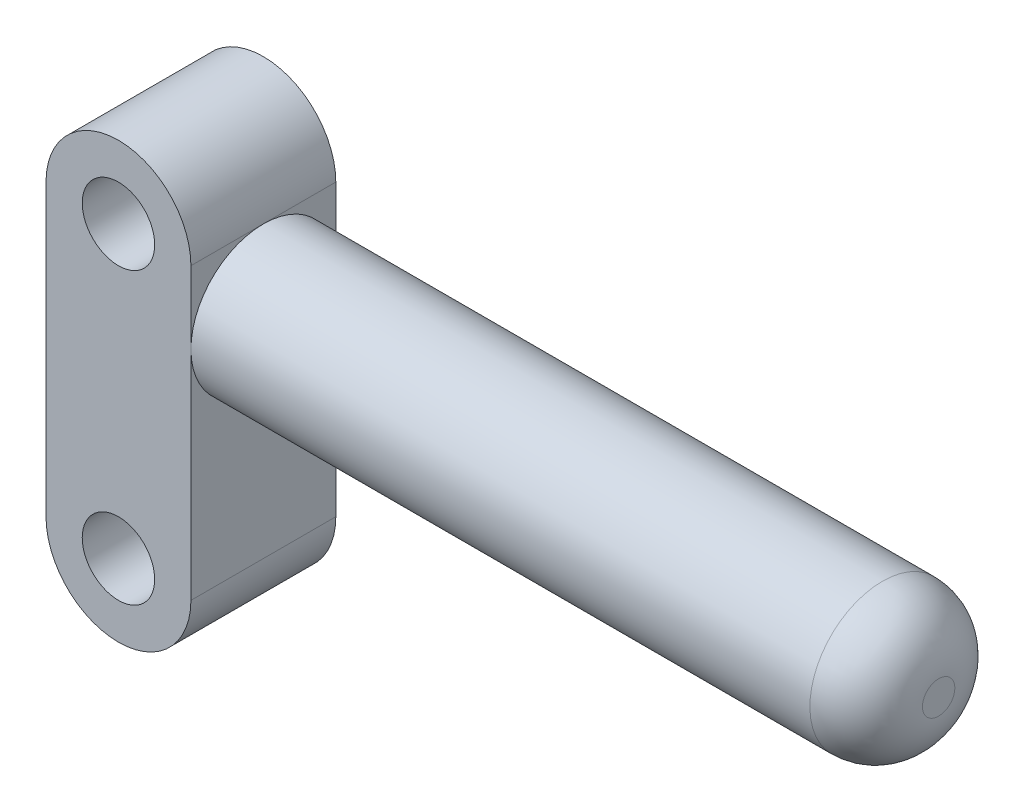
ISO-10303-21;
HEADER;
FILE_DESCRIPTION(('STEP AP214'),'2;1');
FILE_NAME('part.step','',(''),(''),'','','');
FILE_SCHEMA(('AUTOMOTIVE_DESIGN { 1 0 10303 214 1 1 1 1 }'));
ENDSEC;
DATA;
#1=APPLICATION_CONTEXT('core data for automotive mechanical design processes');
#2=APPLICATION_PROTOCOL_DEFINITION('international standard','automotive_design',2000,#1);
#3=PRODUCT_CONTEXT('',#1,'mechanical');
#4=PRODUCT('Part','Part','',(#3));
#5=PRODUCT_RELATED_PRODUCT_CATEGORY('part','',(#4));
#6=PRODUCT_DEFINITION_FORMATION('','',#4);
#7=PRODUCT_DEFINITION_CONTEXT('part definition',#1,'design');
#8=PRODUCT_DEFINITION('design','',#6,#7);
#9=PRODUCT_DEFINITION_SHAPE('','',#8);
#10=(LENGTH_UNIT() NAMED_UNIT(*) SI_UNIT(.MILLI.,.METRE.));
#11=(NAMED_UNIT(*) PLANE_ANGLE_UNIT() SI_UNIT($,.RADIAN.));
#12=(NAMED_UNIT(*) SI_UNIT($,.STERADIAN.) SOLID_ANGLE_UNIT());
#13=UNCERTAINTY_MEASURE_WITH_UNIT(LENGTH_MEASURE(1.E-05),#10,'distance_accuracy_value','');
#14=(GEOMETRIC_REPRESENTATION_CONTEXT(3) GLOBAL_UNCERTAINTY_ASSIGNED_CONTEXT((#13)) GLOBAL_UNIT_ASSIGNED_CONTEXT((#10,
#11,#12)) REPRESENTATION_CONTEXT('',''));
#15=CARTESIAN_POINT('',(0.,0.,0.));
#16=DIRECTION('',(0.,0.,1.));
#17=DIRECTION('',(1.,0.,0.));
#18=AXIS2_PLACEMENT_3D('',#15,#16,#17);
#19=CARTESIAN_POINT('',(5.,10.,5.));
#20=DIRECTION('',(-1.,0.,0.));
#21=DIRECTION('',(0.,-1.,0.));
#22=AXIS2_PLACEMENT_3D('',#19,#20,#21);
#23=PLANE('',#22);
#24=CARTESIAN_POINT('',(5.,5.,0.));
#25=DIRECTION('',(-1.,0.,0.));
#26=DIRECTION('',(0.,-1.,0.));
#27=AXIS2_PLACEMENT_3D('',#24,#25,#26);
#28=CIRCLE('',#27,5.);
#29=CARTESIAN_POINT('',(5.,5.,-5.));
#30=VERTEX_POINT('',#29);
#31=CARTESIAN_POINT('',(5.,10.,0.));
#32=VERTEX_POINT('',#31);
#33=EDGE_CURVE('E107',#30,#32,#28,.F.);
#34=ORIENTED_EDGE('',*,*,#33,.F.);
#35=DIRECTION('',(0.,1.,0.));
#36=VECTOR('',#35,1.);
#37=CARTESIAN_POINT('',(5.,10.,-5.));
#38=LINE('',#37,#36);
#39=CARTESIAN_POINT('',(5.,10.,-5.));
#40=VERTEX_POINT('',#39);
#41=EDGE_CURVE('E95',#30,#40,#38,.T.);
#42=ORIENTED_EDGE('',*,*,#41,.T.);
#43=DIRECTION('',(0.,0.,-1.));
#44=VECTOR('',#43,1.);
#45=CARTESIAN_POINT('',(5.,10.,5.));
#46=LINE('',#45,#44);
#47=EDGE_CURVE('E108',#32,#40,#46,.T.);
#48=ORIENTED_EDGE('',*,*,#47,.F.);
#49=EDGE_LOOP('',(#34,#42,#48));
#50=FACE_BOUND('',#49,.T.);
#51=ADVANCED_FACE('F36',(#50),#23,.F.);
#52=CARTESIAN_POINT('',(5.,5.,0.));
#53=DIRECTION('',(1.,0.,0.));
#54=DIRECTION('',(0.,1.,0.));
#55=AXIS2_PLACEMENT_3D('',#52,#53,#54);
#56=CIRCLE('',#55,5.);
#57=CARTESIAN_POINT('',(5.,5.,5.));
#58=VERTEX_POINT('',#57);
#59=EDGE_CURVE('E58',#32,#58,#56,.T.);
#60=ORIENTED_EDGE('',*,*,#59,.F.);
#61=CARTESIAN_POINT('',(5.,10.,5.));
#62=VERTEX_POINT('',#61);
#63=EDGE_CURVE('E176',#62,#32,#46,.T.);
#64=ORIENTED_EDGE('',*,*,#63,.F.);
#65=DIRECTION('',(0.,1.,0.));
#66=VECTOR('',#65,1.);
#67=CARTESIAN_POINT('',(5.,10.,5.));
#68=LINE('',#67,#66);
#69=EDGE_CURVE('E188',#58,#62,#68,.T.);
#70=ORIENTED_EDGE('',*,*,#69,.F.);
#71=EDGE_LOOP('',(#60,#64,#70));
#72=FACE_BOUND('',#71,.T.);
#73=ADVANCED_FACE('F131',(#72),#23,.F.);
#74=CARTESIAN_POINT('',(0.,10.,5.));
#75=DIRECTION('',(0.,0.,1.));
#76=DIRECTION('',(1.,0.,0.));
#77=AXIS2_PLACEMENT_3D('',#74,#75,#76);
#78=PLANE('',#77);
#79=CARTESIAN_POINT('',(0.,10.,5.));
#80=DIRECTION('',(0.,0.,1.));
#81=DIRECTION('',(1.,0.,0.));
#82=AXIS2_PLACEMENT_3D('',#79,#80,#81);
#83=CIRCLE('',#82,2.5);
#84=CARTESIAN_POINT('',(2.5,10.,5.));
#85=VERTEX_POINT('',#84);
#86=EDGE_CURVE('E165',#85,#85,#83,.T.);
#87=ORIENTED_EDGE('',*,*,#86,.F.);
#88=EDGE_LOOP('',(#87));
#89=FACE_BOUND('',#88,.T.);
#90=CARTESIAN_POINT('',(0.,10.,5.));
#91=DIRECTION('',(0.,0.,1.));
#92=DIRECTION('',(1.,0.,0.));
#93=AXIS2_PLACEMENT_3D('',#90,#91,#92);
#94=CIRCLE('',#93,5.);
#95=CARTESIAN_POINT('',(-5.,10.,5.));
#96=VERTEX_POINT('',#95);
#97=EDGE_CURVE('E94',#62,#96,#94,.T.);
#98=ORIENTED_EDGE('',*,*,#97,.T.);
#99=DIRECTION('',(0.,-1.,0.));
#100=VECTOR('',#99,1.);
#101=CARTESIAN_POINT('',(-5.,10.,5.));
#102=LINE('',#101,#100);
#103=CARTESIAN_POINT('',(-4.99999999999999,-10.,5.));
#104=VERTEX_POINT('',#103);
#105=EDGE_CURVE('E182',#96,#104,#102,.T.);
#106=ORIENTED_EDGE('',*,*,#105,.T.);
#107=CARTESIAN_POINT('',(0.,-10.,5.));
#108=DIRECTION('',(0.,0.,1.));
#109=DIRECTION('',(1.,0.,0.));
#110=AXIS2_PLACEMENT_3D('',#107,#108,#109);
#111=CIRCLE('',#110,5.);
#112=CARTESIAN_POINT('',(5.,-10.,5.));
#113=VERTEX_POINT('',#112);
#114=EDGE_CURVE('E181',#104,#113,#111,.T.);
#115=ORIENTED_EDGE('',*,*,#114,.T.);
#116=EDGE_CURVE('E172',#113,#58,#68,.T.);
#117=ORIENTED_EDGE('',*,*,#116,.T.);
#118=ORIENTED_EDGE('',*,*,#69,.T.);
#119=EDGE_LOOP('',(#98,#106,#115,#117,#118));
#120=FACE_BOUND('',#119,.T.);
#121=CARTESIAN_POINT('',(0.,-10.,5.));
#122=DIRECTION('',(0.,0.,1.));
#123=DIRECTION('',(-1.,0.,0.));
#124=AXIS2_PLACEMENT_3D('',#121,#122,#123);
#125=CIRCLE('',#124,2.5);
#126=CARTESIAN_POINT('',(-2.5,-10.,5.));
#127=VERTEX_POINT('',#126);
#128=EDGE_CURVE('E192',#127,#127,#125,.T.);
#129=ORIENTED_EDGE('',*,*,#128,.F.);
#130=EDGE_LOOP('',(#129));
#131=FACE_BOUND('',#130,.T.);
#132=ADVANCED_FACE('F136',(#89,#120,#131),#78,.T.);
#133=CARTESIAN_POINT('',(0.,10.,-5.));
#134=DIRECTION('',(0.,0.,1.));
#135=DIRECTION('',(1.,0.,0.));
#136=AXIS2_PLACEMENT_3D('',#133,#134,#135);
#137=PLANE('',#136);
#138=CARTESIAN_POINT('',(0.,10.,-5.));
#139=DIRECTION('',(0.,0.,1.));
#140=DIRECTION('',(1.,0.,0.));
#141=AXIS2_PLACEMENT_3D('',#138,#139,#140);
#142=CIRCLE('',#141,5.);
#143=CARTESIAN_POINT('',(-5.,10.,-5.));
#144=VERTEX_POINT('',#143);
#145=EDGE_CURVE('E103',#40,#144,#142,.T.);
#146=ORIENTED_EDGE('',*,*,#145,.F.);
#147=ORIENTED_EDGE('',*,*,#41,.F.);
#148=CARTESIAN_POINT('',(5.,-10.,-5.));
#149=VERTEX_POINT('',#148);
#150=EDGE_CURVE('E87',#149,#30,#38,.T.);
#151=ORIENTED_EDGE('',*,*,#150,.F.);
#152=CARTESIAN_POINT('',(0.,-10.,-5.));
#153=DIRECTION('',(0.,0.,1.));
#154=DIRECTION('',(1.,0.,0.));
#155=AXIS2_PLACEMENT_3D('',#152,#153,#154);
#156=CIRCLE('',#155,5.);
#157=CARTESIAN_POINT('',(-4.99999999999999,-10.,-5.));
#158=VERTEX_POINT('',#157);
#159=EDGE_CURVE('E105',#158,#149,#156,.T.);
#160=ORIENTED_EDGE('',*,*,#159,.F.);
#161=DIRECTION('',(0.,-1.,0.));
#162=VECTOR('',#161,1.);
#163=CARTESIAN_POINT('',(-5.,10.,-5.));
#164=LINE('',#163,#162);
#165=EDGE_CURVE('E164',#144,#158,#164,.T.);
#166=ORIENTED_EDGE('',*,*,#165,.F.);
#167=EDGE_LOOP('',(#146,#147,#151,#160,#166));
#168=FACE_BOUND('',#167,.T.);
#169=CARTESIAN_POINT('',(0.,10.,-5.));
#170=DIRECTION('',(0.,0.,1.));
#171=DIRECTION('',(1.,0.,0.));
#172=AXIS2_PLACEMENT_3D('',#169,#170,#171);
#173=CIRCLE('',#172,2.5);
#174=CARTESIAN_POINT('',(2.5,10.,-5.));
#175=VERTEX_POINT('',#174);
#176=EDGE_CURVE('E169',#175,#175,#173,.T.);
#177=ORIENTED_EDGE('',*,*,#176,.T.);
#178=EDGE_LOOP('',(#177));
#179=FACE_BOUND('',#178,.T.);
#180=CARTESIAN_POINT('',(0.,-10.,-5.));
#181=DIRECTION('',(0.,0.,1.));
#182=DIRECTION('',(-1.,0.,0.));
#183=AXIS2_PLACEMENT_3D('',#180,#181,#182);
#184=CIRCLE('',#183,2.5);
#185=CARTESIAN_POINT('',(-2.5,-10.,-5.));
#186=VERTEX_POINT('',#185);
#187=EDGE_CURVE('E194',#186,#186,#184,.T.);
#188=ORIENTED_EDGE('',*,*,#187,.T.);
#189=EDGE_LOOP('',(#188));
#190=FACE_BOUND('',#189,.T.);
#191=ADVANCED_FACE('F100',(#168,#179,#190),#137,.F.);
#192=CARTESIAN_POINT('',(0.,10.,5.));
#193=DIRECTION('',(0.,0.,-1.));
#194=DIRECTION('',(-1.,0.,0.));
#195=AXIS2_PLACEMENT_3D('',#192,#193,#194);
#196=CYLINDRICAL_SURFACE('',#195,5.);
#197=ORIENTED_EDGE('',*,*,#145,.T.);
#198=DIRECTION('',(0.,0.,-1.));
#199=VECTOR('',#198,1.);
#200=CARTESIAN_POINT('',(-5.,10.,5.));
#201=LINE('',#200,#199);
#202=EDGE_CURVE('E113',#96,#144,#201,.T.);
#203=ORIENTED_EDGE('',*,*,#202,.F.);
#204=ORIENTED_EDGE('',*,*,#97,.F.);
#205=ORIENTED_EDGE('',*,*,#63,.T.);
#206=ORIENTED_EDGE('',*,*,#47,.T.);
#207=EDGE_LOOP('',(#197,#203,#204,#205,#206));
#208=FACE_BOUND('',#207,.T.);
#209=ADVANCED_FACE('F154',(#208),#196,.T.);
#210=CARTESIAN_POINT('',(-5.,10.,5.));
#211=DIRECTION('',(1.,0.,0.));
#212=DIRECTION('',(0.,1.,0.));
#213=AXIS2_PLACEMENT_3D('',#210,#211,#212);
#214=PLANE('',#213);
#215=ORIENTED_EDGE('',*,*,#165,.T.);
#216=DIRECTION('',(0.,0.,-1.));
#217=VECTOR('',#216,1.);
#218=CARTESIAN_POINT('',(-4.99999999999999,-10.,5.));
#219=LINE('',#218,#217);
#220=EDGE_CURVE('E115',#104,#158,#219,.T.);
#221=ORIENTED_EDGE('',*,*,#220,.F.);
#222=ORIENTED_EDGE('',*,*,#105,.F.);
#223=ORIENTED_EDGE('',*,*,#202,.T.);
#224=EDGE_LOOP('',(#215,#221,#222,#223));
#225=FACE_BOUND('',#224,.T.);
#226=ADVANCED_FACE('F149',(#225),#214,.F.);
#227=CARTESIAN_POINT('',(0.,-10.,5.));
#228=DIRECTION('',(0.,0.,-1.));
#229=DIRECTION('',(-1.,0.,0.));
#230=AXIS2_PLACEMENT_3D('',#227,#228,#229);
#231=CYLINDRICAL_SURFACE('',#230,5.);
#232=ORIENTED_EDGE('',*,*,#159,.T.);
#233=DIRECTION('',(0.,0.,-1.));
#234=VECTOR('',#233,1.);
#235=CARTESIAN_POINT('',(5.,-10.,5.));
#236=LINE('',#235,#234);
#237=EDGE_CURVE('E91',#113,#149,#236,.T.);
#238=ORIENTED_EDGE('',*,*,#237,.F.);
#239=ORIENTED_EDGE('',*,*,#114,.F.);
#240=ORIENTED_EDGE('',*,*,#220,.T.);
#241=EDGE_LOOP('',(#232,#238,#239,#240));
#242=FACE_BOUND('',#241,.T.);
#243=ADVANCED_FACE('F141',(#242),#231,.T.);
#244=EDGE_CURVE('E51',#58,#30,#28,.F.);
#245=ORIENTED_EDGE('',*,*,#244,.F.);
#246=ORIENTED_EDGE('',*,*,#116,.F.);
#247=ORIENTED_EDGE('',*,*,#237,.T.);
#248=ORIENTED_EDGE('',*,*,#150,.T.);
#249=EDGE_LOOP('',(#245,#246,#247,#248));
#250=FACE_BOUND('',#249,.T.);
#251=ADVANCED_FACE('F89',(#250),#23,.F.);
#252=CARTESIAN_POINT('',(0.,10.,5.));
#253=DIRECTION('',(0.,0.,-1.));
#254=DIRECTION('',(-1.,0.,0.));
#255=AXIS2_PLACEMENT_3D('',#252,#253,#254);
#256=CYLINDRICAL_SURFACE('',#255,2.5);
#257=ORIENTED_EDGE('',*,*,#86,.T.);
#258=EDGE_LOOP('',(#257));
#259=FACE_BOUND('',#258,.T.);
#260=ORIENTED_EDGE('',*,*,#176,.F.);
#261=EDGE_LOOP('',(#260));
#262=FACE_BOUND('',#261,.T.);
#263=ADVANCED_FACE('F140',(#259,#262),#256,.F.);
#264=CARTESIAN_POINT('',(0.,-10.,5.));
#265=DIRECTION('',(0.,0.,-1.));
#266=DIRECTION('',(-1.,0.,0.));
#267=AXIS2_PLACEMENT_3D('',#264,#265,#266);
#268=CYLINDRICAL_SURFACE('',#267,2.5);
#269=ORIENTED_EDGE('',*,*,#128,.T.);
#270=EDGE_LOOP('',(#269));
#271=FACE_BOUND('',#270,.T.);
#272=ORIENTED_EDGE('',*,*,#187,.F.);
#273=EDGE_LOOP('',(#272));
#274=FACE_BOUND('',#273,.T.);
#275=ADVANCED_FACE('F146',(#271,#274),#268,.F.);
#276=CARTESIAN_POINT('',(51.6,5.00000000000002,0.));
#277=DIRECTION('',(-1.,0.,0.));
#278=DIRECTION('',(0.,-1.,0.));
#279=AXIS2_PLACEMENT_3D('',#276,#277,#278);
#280=CYLINDRICAL_SURFACE('',#279,5.);
#281=CARTESIAN_POINT('',(47.7166666666667,5.00000000000002,0.));
#282=DIRECTION('',(1.,0.,0.));
#283=DIRECTION('',(0.,1.,0.));
#284=AXIS2_PLACEMENT_3D('',#281,#282,#283);
#285=CIRCLE('',#284,5.);
#286=CARTESIAN_POINT('',(47.7166666666667,10.,0.));
#287=VERTEX_POINT('',#286);
#288=EDGE_CURVE('E11',#287,#287,#285,.F.);
#289=ORIENTED_EDGE('',*,*,#288,.T.);
#290=EDGE_LOOP('',(#289));
#291=FACE_BOUND('',#290,.T.);
#292=ORIENTED_EDGE('',*,*,#59,.T.);
#293=ORIENTED_EDGE('',*,*,#244,.T.);
#294=ORIENTED_EDGE('',*,*,#33,.T.);
#295=EDGE_LOOP('',(#292,#293,#294));
#296=FACE_BOUND('',#295,.T.);
#297=ADVANCED_FACE('F112',(#291,#296),#280,.T.);
#298=CARTESIAN_POINT('',(51.6,5.00000000000002,0.));
#299=DIRECTION('',(1.,0.,0.));
#300=DIRECTION('',(0.,1.,0.));
#301=AXIS2_PLACEMENT_3D('',#298,#299,#300);
#302=PLANE('',#301);
#303=CARTESIAN_POINT('',(51.6,5.00000000000002,0.));
#304=DIRECTION('',(1.,0.,0.));
#305=DIRECTION('',(0.,1.,0.));
#306=AXIS2_PLACEMENT_3D('',#303,#304,#305);
#307=CIRCLE('',#306,1.11666666666667);
#308=CARTESIAN_POINT('',(51.6,6.11666666666668,0.));
#309=VERTEX_POINT('',#308);
#310=EDGE_CURVE('E44',#309,#309,#307,.T.);
#311=ORIENTED_EDGE('',*,*,#310,.T.);
#312=EDGE_LOOP('',(#311));
#313=FACE_BOUND('',#312,.T.);
#314=ADVANCED_FACE('F121',(#313),#302,.T.);
#315=CARTESIAN_POINT('',(47.7166666666667,5.00000000000002,0.));
#316=DIRECTION('',(1.,0.,0.));
#317=DIRECTION('',(0.,1.,0.));
#318=AXIS2_PLACEMENT_3D('',#315,#316,#317);
#319=DEGENERATE_TOROIDAL_SURFACE('',#318,1.11666666666667,3.88333333333333,.T.);
#320=ORIENTED_EDGE('',*,*,#288,.F.);
#321=EDGE_LOOP('',(#320));
#322=FACE_BOUND('',#321,.T.);
#323=ORIENTED_EDGE('',*,*,#310,.F.);
#324=EDGE_LOOP('',(#323));
#325=FACE_BOUND('',#324,.T.);
#326=ADVANCED_FACE('F38',(#322,#325),#319,.T.);
#327=CLOSED_SHELL('',(#51,#73,#132,#191,#209,#226,#243,#251,#263,#275,#297,#314,#326));
#328=MANIFOLD_SOLID_BREP('B2',#327);
#329=ADVANCED_BREP_SHAPE_REPRESENTATION('',(#18,#328),#14);
#330=SHAPE_DEFINITION_REPRESENTATION(#9,#329);
ENDSEC;
END-ISO-10303-21;
